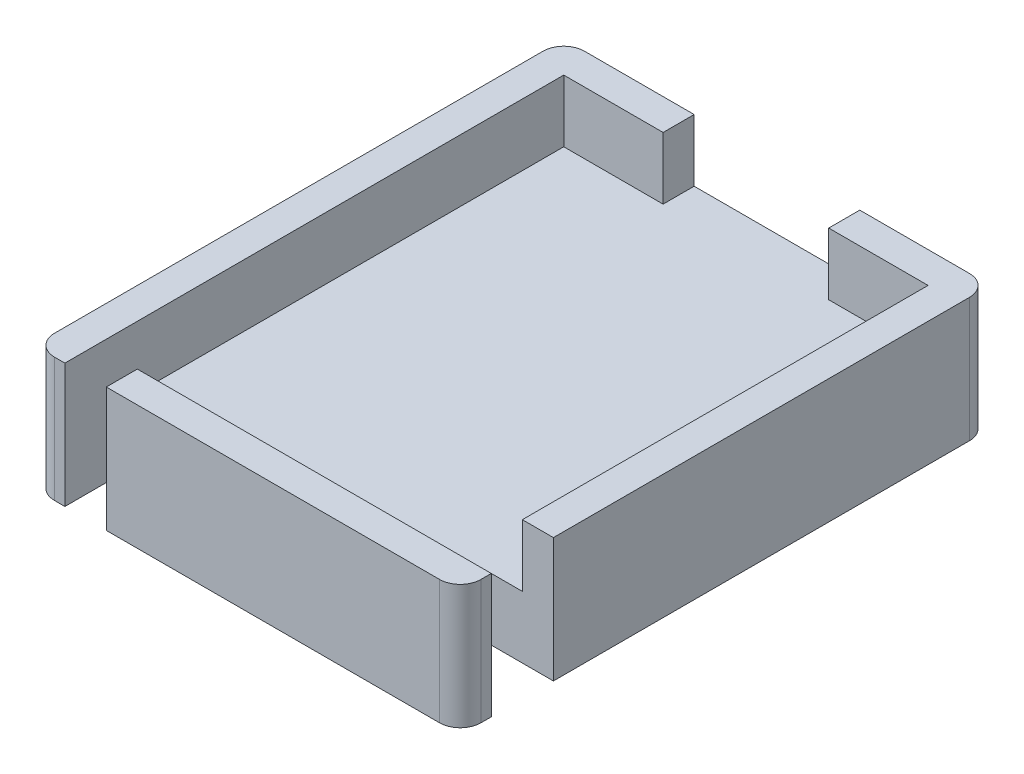
ISO-10303-21;
HEADER;
FILE_DESCRIPTION(('STEP AP214'),'2;1');
FILE_NAME('part.step','',(''),(''),'','','');
FILE_SCHEMA(('AUTOMOTIVE_DESIGN { 1 0 10303 214 1 1 1 1 }'));
ENDSEC;
DATA;
#1=APPLICATION_CONTEXT('core data for automotive mechanical design processes');
#2=APPLICATION_PROTOCOL_DEFINITION('international standard','automotive_design',2000,#1);
#3=PRODUCT_CONTEXT('',#1,'mechanical');
#4=PRODUCT('Part','Part','',(#3));
#5=PRODUCT_RELATED_PRODUCT_CATEGORY('part','',(#4));
#6=PRODUCT_DEFINITION_FORMATION('','',#4);
#7=PRODUCT_DEFINITION_CONTEXT('part definition',#1,'design');
#8=PRODUCT_DEFINITION('design','',#6,#7);
#9=PRODUCT_DEFINITION_SHAPE('','',#8);
#10=(LENGTH_UNIT() NAMED_UNIT(*) SI_UNIT(.MILLI.,.METRE.));
#11=(NAMED_UNIT(*) PLANE_ANGLE_UNIT() SI_UNIT($,.RADIAN.));
#12=(NAMED_UNIT(*) SI_UNIT($,.STERADIAN.) SOLID_ANGLE_UNIT());
#13=UNCERTAINTY_MEASURE_WITH_UNIT(LENGTH_MEASURE(1.E-05),#10,'distance_accuracy_value','');
#14=(GEOMETRIC_REPRESENTATION_CONTEXT(3) GLOBAL_UNCERTAINTY_ASSIGNED_CONTEXT((#13)) GLOBAL_UNIT_ASSIGNED_CONTEXT((#10,
#11,#12)) REPRESENTATION_CONTEXT('',''));
#15=CARTESIAN_POINT('',(0.,0.,0.));
#16=DIRECTION('',(0.,0.,1.));
#17=DIRECTION('',(1.,0.,0.));
#18=AXIS2_PLACEMENT_3D('',#15,#16,#17);
#19=CARTESIAN_POINT('',(0.,3.,12.8));
#20=DIRECTION('',(0.,0.,-1.));
#21=DIRECTION('',(-1.,0.,0.));
#22=AXIS2_PLACEMENT_3D('',#19,#20,#21);
#23=PLANE('',#22);
#24=DIRECTION('',(1.,0.,0.));
#25=VECTOR('',#24,1.);
#26=CARTESIAN_POINT('',(0.,3.,12.8));
#27=LINE('',#26,#25);
#28=CARTESIAN_POINT('',(-6.8,3.,12.8));
#29=VERTEX_POINT('',#28);
#30=CARTESIAN_POINT('',(9.3,3.,12.8));
#31=VERTEX_POINT('',#30);
#32=EDGE_CURVE('E292',#29,#31,#27,.T.);
#33=ORIENTED_EDGE('',*,*,#32,.F.);
#34=DIRECTION('',(0.,1.,0.));
#35=VECTOR('',#34,1.);
#36=CARTESIAN_POINT('',(-6.8,3.,12.8));
#37=LINE('',#36,#35);
#38=CARTESIAN_POINT('',(-6.8,-3.,12.8));
#39=VERTEX_POINT('',#38);
#40=EDGE_CURVE('E223',#39,#29,#37,.T.);
#41=ORIENTED_EDGE('',*,*,#40,.F.);
#42=DIRECTION('',(1.,0.,0.));
#43=VECTOR('',#42,1.);
#44=CARTESIAN_POINT('',(0.,-3.,12.8));
#45=LINE('',#44,#43);
#46=CARTESIAN_POINT('',(9.3,-3.,12.8));
#47=VERTEX_POINT('',#46);
#48=EDGE_CURVE('E265',#39,#47,#45,.T.);
#49=ORIENTED_EDGE('',*,*,#48,.T.);
#50=DIRECTION('',(0.,-1.,0.));
#51=VECTOR('',#50,1.);
#52=CARTESIAN_POINT('',(9.3,3.,12.8));
#53=LINE('',#52,#51);
#54=EDGE_CURVE('E436',#31,#47,#53,.T.);
#55=ORIENTED_EDGE('',*,*,#54,.F.);
#56=EDGE_LOOP('',(#33,#41,#49,#55));
#57=FACE_BOUND('',#56,.T.);
#58=ADVANCED_FACE('F35',(#57),#23,.F.);
#59=CARTESIAN_POINT('',(0.,3.,0.));
#60=DIRECTION('',(0.,1.,0.));
#61=DIRECTION('',(0.,0.,1.));
#62=AXIS2_PLACEMENT_3D('',#59,#60,#61);
#63=PLANE('',#62);
#64=DIRECTION('',(0.,0.,1.));
#65=VECTOR('',#64,1.);
#66=CARTESIAN_POINT('',(-6.8,3.,8.8));
#67=LINE('',#66,#65);
#68=CARTESIAN_POINT('',(-6.8,3.,11.3));
#69=VERTEX_POINT('',#68);
#70=EDGE_CURVE('E214',#69,#29,#67,.T.);
#71=ORIENTED_EDGE('',*,*,#70,.T.);
#72=ORIENTED_EDGE('',*,*,#32,.T.);
#73=CARTESIAN_POINT('',(9.3,3.,11.8));
#74=DIRECTION('',(0.,1.,0.));
#75=DIRECTION('',(0.,0.,1.));
#76=AXIS2_PLACEMENT_3D('',#73,#74,#75);
#77=CIRCLE('',#76,0.999999999999999);
#78=CARTESIAN_POINT('',(10.3,3.,11.8));
#79=VERTEX_POINT('',#78);
#80=EDGE_CURVE('E296',#79,#31,#77,.F.);
#81=ORIENTED_EDGE('',*,*,#80,.F.);
#82=DIRECTION('',(0.,0.,1.));
#83=VECTOR('',#82,1.);
#84=CARTESIAN_POINT('',(10.3,3.,0.));
#85=LINE('',#84,#83);
#86=CARTESIAN_POINT('',(10.3,3.,11.3));
#87=VERTEX_POINT('',#86);
#88=EDGE_CURVE('E299',#87,#79,#85,.T.);
#89=ORIENTED_EDGE('',*,*,#88,.F.);
#90=DIRECTION('',(1.,0.,0.));
#91=VECTOR('',#90,1.);
#92=CARTESIAN_POINT('',(0.,3.,11.3));
#93=LINE('',#92,#91);
#94=EDGE_CURVE('E314',#69,#87,#93,.T.);
#95=ORIENTED_EDGE('',*,*,#94,.F.);
#96=EDGE_LOOP('',(#71,#72,#81,#89,#95));
#97=FACE_BOUND('',#96,.T.);
#98=ADVANCED_FACE('F415',(#97),#63,.T.);
#99=CARTESIAN_POINT('',(10.3,3.,0.));
#100=DIRECTION('',(1.,0.,0.));
#101=DIRECTION('',(0.,0.,-1.));
#102=AXIS2_PLACEMENT_3D('',#99,#100,#101);
#103=PLANE('',#102);
#104=DIRECTION('',(0.,1.,0.));
#105=VECTOR('',#104,1.);
#106=CARTESIAN_POINT('',(10.3,3.,8.3));
#107=LINE('',#106,#105);
#108=CARTESIAN_POINT('',(10.3,-3.,8.3));
#109=VERTEX_POINT('',#108);
#110=CARTESIAN_POINT('',(10.3,3.,8.3));
#111=VERTEX_POINT('',#110);
#112=EDGE_CURVE('E229',#109,#111,#107,.T.);
#113=ORIENTED_EDGE('',*,*,#112,.F.);
#114=DIRECTION('',(0.,0.,1.));
#115=VECTOR('',#114,1.);
#116=CARTESIAN_POINT('',(10.3,-3.,0.));
#117=LINE('',#116,#115);
#118=CARTESIAN_POINT('',(10.3,-3.,-11.8));
#119=VERTEX_POINT('',#118);
#120=EDGE_CURVE('E272',#119,#109,#117,.T.);
#121=ORIENTED_EDGE('',*,*,#120,.F.);
#122=DIRECTION('',(0.,-1.,0.));
#123=VECTOR('',#122,1.);
#124=CARTESIAN_POINT('',(10.3,3.,-11.8));
#125=LINE('',#124,#123);
#126=CARTESIAN_POINT('',(10.3,3.,-11.8));
#127=VERTEX_POINT('',#126);
#128=EDGE_CURVE('E443',#127,#119,#125,.T.);
#129=ORIENTED_EDGE('',*,*,#128,.F.);
#130=EDGE_CURVE('E300',#127,#111,#85,.T.);
#131=ORIENTED_EDGE('',*,*,#130,.T.);
#132=EDGE_LOOP('',(#113,#121,#129,#131));
#133=FACE_BOUND('',#132,.T.);
#134=ADVANCED_FACE('F412',(#133),#103,.T.);
#135=DIRECTION('',(1.,0.,0.));
#136=VECTOR('',#135,1.);
#137=CARTESIAN_POINT('',(6.3,3.,8.3));
#138=LINE('',#137,#136);
#139=CARTESIAN_POINT('',(8.8,3.,8.3));
#140=VERTEX_POINT('',#139);
#141=EDGE_CURVE('E236',#140,#111,#138,.T.);
#142=ORIENTED_EDGE('',*,*,#141,.T.);
#143=ORIENTED_EDGE('',*,*,#130,.F.);
#144=CARTESIAN_POINT('',(9.3,3.,-11.8));
#145=DIRECTION('',(0.,1.,0.));
#146=DIRECTION('',(0.,0.,1.));
#147=AXIS2_PLACEMENT_3D('',#144,#145,#146);
#148=CIRCLE('',#147,1.);
#149=CARTESIAN_POINT('',(9.3,3.,-12.8));
#150=VERTEX_POINT('',#149);
#151=EDGE_CURVE('E303',#150,#127,#148,.F.);
#152=ORIENTED_EDGE('',*,*,#151,.F.);
#153=DIRECTION('',(1.,0.,0.));
#154=VECTOR('',#153,1.);
#155=CARTESIAN_POINT('',(0.,3.,-12.8));
#156=LINE('',#155,#154);
#157=CARTESIAN_POINT('',(4.,3.,-12.8));
#158=VERTEX_POINT('',#157);
#159=EDGE_CURVE('E285',#158,#150,#156,.T.);
#160=ORIENTED_EDGE('',*,*,#159,.F.);
#161=DIRECTION('',(0.,0.,1.));
#162=VECTOR('',#161,1.);
#163=CARTESIAN_POINT('',(4.,3.,0.));
#164=LINE('',#163,#162);
#165=CARTESIAN_POINT('',(4.,3.,-11.3));
#166=VERTEX_POINT('',#165);
#167=EDGE_CURVE('E306',#158,#166,#164,.T.);
#168=ORIENTED_EDGE('',*,*,#167,.T.);
#169=DIRECTION('',(1.,0.,0.));
#170=VECTOR('',#169,1.);
#171=CARTESIAN_POINT('',(0.,3.,-11.3));
#172=LINE('',#171,#170);
#173=CARTESIAN_POINT('',(8.8,3.,-11.3));
#174=VERTEX_POINT('',#173);
#175=EDGE_CURVE('E308',#166,#174,#172,.T.);
#176=ORIENTED_EDGE('',*,*,#175,.T.);
#177=DIRECTION('',(0.,0.,1.));
#178=VECTOR('',#177,1.);
#179=CARTESIAN_POINT('',(8.8,3.,0.));
#180=LINE('',#179,#178);
#181=EDGE_CURVE('E310',#174,#140,#180,.T.);
#182=ORIENTED_EDGE('',*,*,#181,.T.);
#183=EDGE_LOOP('',(#142,#143,#152,#160,#168,#176,#182));
#184=FACE_BOUND('',#183,.T.);
#185=ADVANCED_FACE('F406',(#184),#63,.T.);
#186=CARTESIAN_POINT('',(-9.3,3.,-11.8));
#187=DIRECTION('',(0.,-1.,0.));
#188=DIRECTION('',(0.,0.,-1.));
#189=AXIS2_PLACEMENT_3D('',#186,#187,#188);
#190=CYLINDRICAL_SURFACE('',#189,1.);
#191=DIRECTION('',(0.,-1.,0.));
#192=VECTOR('',#191,1.);
#193=CARTESIAN_POINT('',(-9.3,3.,-12.8));
#194=LINE('',#193,#192);
#195=CARTESIAN_POINT('',(-9.3,3.,-12.8));
#196=VERTEX_POINT('',#195);
#197=CARTESIAN_POINT('',(-9.3,-3.,-12.8));
#198=VERTEX_POINT('',#197);
#199=EDGE_CURVE('E346',#196,#198,#194,.T.);
#200=ORIENTED_EDGE('',*,*,#199,.T.);
#201=CARTESIAN_POINT('',(-9.3,-3.,-11.8));
#202=DIRECTION('',(0.,1.,0.));
#203=DIRECTION('',(0.,0.,1.));
#204=AXIS2_PLACEMENT_3D('',#201,#202,#203);
#205=CIRCLE('',#204,1.);
#206=CARTESIAN_POINT('',(-10.3,-3.,-11.8));
#207=VERTEX_POINT('',#206);
#208=EDGE_CURVE('E256',#198,#207,#205,.T.);
#209=ORIENTED_EDGE('',*,*,#208,.T.);
#210=DIRECTION('',(0.,-1.,0.));
#211=VECTOR('',#210,1.);
#212=CARTESIAN_POINT('',(-10.3,3.,-11.8));
#213=LINE('',#212,#211);
#214=CARTESIAN_POINT('',(-10.3,3.,-11.8));
#215=VERTEX_POINT('',#214);
#216=EDGE_CURVE('E379',#215,#207,#213,.T.);
#217=ORIENTED_EDGE('',*,*,#216,.F.);
#218=CARTESIAN_POINT('',(-9.3,3.,-11.8));
#219=DIRECTION('',(0.,1.,0.));
#220=DIRECTION('',(0.,0.,1.));
#221=AXIS2_PLACEMENT_3D('',#218,#219,#220);
#222=CIRCLE('',#221,1.);
#223=EDGE_CURVE('E283',#196,#215,#222,.T.);
#224=ORIENTED_EDGE('',*,*,#223,.F.);
#225=EDGE_LOOP('',(#200,#209,#217,#224));
#226=FACE_BOUND('',#225,.T.);
#227=ADVANCED_FACE('F37',(#226),#190,.T.);
#228=CARTESIAN_POINT('',(-10.3,3.,0.));
#229=DIRECTION('',(1.,0.,0.));
#230=DIRECTION('',(0.,0.,-1.));
#231=AXIS2_PLACEMENT_3D('',#228,#229,#230);
#232=PLANE('',#231);
#233=ORIENTED_EDGE('',*,*,#216,.T.);
#234=DIRECTION('',(0.,0.,1.));
#235=VECTOR('',#234,1.);
#236=CARTESIAN_POINT('',(-10.3,-3.,0.));
#237=LINE('',#236,#235);
#238=CARTESIAN_POINT('',(-10.3,-3.,11.8));
#239=VERTEX_POINT('',#238);
#240=EDGE_CURVE('E259',#207,#239,#237,.T.);
#241=ORIENTED_EDGE('',*,*,#240,.T.);
#242=DIRECTION('',(0.,-1.,0.));
#243=VECTOR('',#242,1.);
#244=CARTESIAN_POINT('',(-10.3,3.,11.8));
#245=LINE('',#244,#243);
#246=CARTESIAN_POINT('',(-10.3,3.,11.8));
#247=VERTEX_POINT('',#246);
#248=EDGE_CURVE('E377',#247,#239,#245,.T.);
#249=ORIENTED_EDGE('',*,*,#248,.F.);
#250=DIRECTION('',(0.,0.,1.));
#251=VECTOR('',#250,1.);
#252=CARTESIAN_POINT('',(-10.3,3.,0.));
#253=LINE('',#252,#251);
#254=EDGE_CURVE('E287',#215,#247,#253,.T.);
#255=ORIENTED_EDGE('',*,*,#254,.F.);
#256=EDGE_LOOP('',(#233,#241,#249,#255));
#257=FACE_BOUND('',#256,.T.);
#258=ADVANCED_FACE('F375',(#257),#232,.F.);
#259=CARTESIAN_POINT('',(-9.3,3.,11.8));
#260=DIRECTION('',(0.,-1.,0.));
#261=DIRECTION('',(0.,0.,-1.));
#262=AXIS2_PLACEMENT_3D('',#259,#260,#261);
#263=CYLINDRICAL_SURFACE('',#262,1.);
#264=ORIENTED_EDGE('',*,*,#248,.T.);
#265=CARTESIAN_POINT('',(-9.3,-3.,11.8));
#266=DIRECTION('',(0.,1.,0.));
#267=DIRECTION('',(0.,0.,1.));
#268=AXIS2_PLACEMENT_3D('',#265,#266,#267);
#269=CIRCLE('',#268,1.);
#270=CARTESIAN_POINT('',(-9.3,-3.,12.8));
#271=VERTEX_POINT('',#270);
#272=EDGE_CURVE('E262',#271,#239,#269,.F.);
#273=ORIENTED_EDGE('',*,*,#272,.F.);
#274=DIRECTION('',(0.,-1.,0.));
#275=VECTOR('',#274,1.);
#276=CARTESIAN_POINT('',(-9.3,3.,12.8));
#277=LINE('',#276,#275);
#278=CARTESIAN_POINT('',(-9.3,3.,12.8));
#279=VERTEX_POINT('',#278);
#280=EDGE_CURVE('E368',#279,#271,#277,.T.);
#281=ORIENTED_EDGE('',*,*,#280,.F.);
#282=CARTESIAN_POINT('',(-9.3,3.,11.8));
#283=DIRECTION('',(0.,1.,0.));
#284=DIRECTION('',(0.,0.,1.));
#285=AXIS2_PLACEMENT_3D('',#282,#283,#284);
#286=CIRCLE('',#285,1.);
#287=EDGE_CURVE('E289',#279,#247,#286,.F.);
#288=ORIENTED_EDGE('',*,*,#287,.T.);
#289=EDGE_LOOP('',(#264,#273,#281,#288));
#290=FACE_BOUND('',#289,.T.);
#291=ADVANCED_FACE('F411',(#290),#263,.T.);
#292=CARTESIAN_POINT('',(-8.8,-3.,12.8));
#293=VERTEX_POINT('',#292);
#294=EDGE_CURVE('E266',#271,#293,#45,.T.);
#295=ORIENTED_EDGE('',*,*,#294,.T.);
#296=DIRECTION('',(0.,-1.,0.));
#297=VECTOR('',#296,1.);
#298=CARTESIAN_POINT('',(-8.8,3.,12.8));
#299=LINE('',#298,#297);
#300=CARTESIAN_POINT('',(-8.8,3.,12.8));
#301=VERTEX_POINT('',#300);
#302=EDGE_CURVE('E209',#301,#293,#299,.T.);
#303=ORIENTED_EDGE('',*,*,#302,.F.);
#304=EDGE_CURVE('E293',#279,#301,#27,.T.);
#305=ORIENTED_EDGE('',*,*,#304,.F.);
#306=ORIENTED_EDGE('',*,*,#280,.T.);
#307=EDGE_LOOP('',(#295,#303,#305,#306));
#308=FACE_BOUND('',#307,.T.);
#309=ADVANCED_FACE('F367',(#308),#23,.F.);
#310=CARTESIAN_POINT('',(9.3,3.,11.8));
#311=DIRECTION('',(0.,-1.,0.));
#312=DIRECTION('',(0.,0.,-1.));
#313=AXIS2_PLACEMENT_3D('',#310,#311,#312);
#314=CYLINDRICAL_SURFACE('',#313,0.999999999999999);
#315=ORIENTED_EDGE('',*,*,#54,.T.);
#316=CARTESIAN_POINT('',(9.3,-3.,11.8));
#317=DIRECTION('',(0.,1.,0.));
#318=DIRECTION('',(0.,0.,1.));
#319=AXIS2_PLACEMENT_3D('',#316,#317,#318);
#320=CIRCLE('',#319,0.999999999999999);
#321=CARTESIAN_POINT('',(10.3,-3.,11.8));
#322=VERTEX_POINT('',#321);
#323=EDGE_CURVE('E268',#322,#47,#320,.F.);
#324=ORIENTED_EDGE('',*,*,#323,.F.);
#325=DIRECTION('',(0.,-1.,0.));
#326=VECTOR('',#325,1.);
#327=CARTESIAN_POINT('',(10.3,3.,11.8));
#328=LINE('',#327,#326);
#329=EDGE_CURVE('E438',#79,#322,#328,.T.);
#330=ORIENTED_EDGE('',*,*,#329,.F.);
#331=ORIENTED_EDGE('',*,*,#80,.T.);
#332=EDGE_LOOP('',(#315,#324,#330,#331));
#333=FACE_BOUND('',#332,.T.);
#334=ADVANCED_FACE('F427',(#333),#314,.T.);
#335=DIRECTION('',(0.,-1.,0.));
#336=VECTOR('',#335,1.);
#337=CARTESIAN_POINT('',(10.3,3.,11.3));
#338=LINE('',#337,#336);
#339=CARTESIAN_POINT('',(10.3,-3.,11.3));
#340=VERTEX_POINT('',#339);
#341=EDGE_CURVE('E232',#87,#340,#338,.T.);
#342=ORIENTED_EDGE('',*,*,#341,.F.);
#343=ORIENTED_EDGE('',*,*,#88,.T.);
#344=ORIENTED_EDGE('',*,*,#329,.T.);
#345=EDGE_CURVE('E271',#340,#322,#117,.T.);
#346=ORIENTED_EDGE('',*,*,#345,.F.);
#347=EDGE_LOOP('',(#342,#343,#344,#346));
#348=FACE_BOUND('',#347,.T.);
#349=ADVANCED_FACE('F432',(#348),#103,.T.);
#350=CARTESIAN_POINT('',(9.3,3.,-11.8));
#351=DIRECTION('',(0.,-1.,0.));
#352=DIRECTION('',(0.,0.,-1.));
#353=AXIS2_PLACEMENT_3D('',#350,#351,#352);
#354=CYLINDRICAL_SURFACE('',#353,1.);
#355=ORIENTED_EDGE('',*,*,#128,.T.);
#356=CARTESIAN_POINT('',(9.3,-3.,-11.8));
#357=DIRECTION('',(0.,1.,0.));
#358=DIRECTION('',(0.,0.,1.));
#359=AXIS2_PLACEMENT_3D('',#356,#357,#358);
#360=CIRCLE('',#359,1.);
#361=CARTESIAN_POINT('',(9.3,-3.,-12.8));
#362=VERTEX_POINT('',#361);
#363=EDGE_CURVE('E250',#362,#119,#360,.F.);
#364=ORIENTED_EDGE('',*,*,#363,.F.);
#365=DIRECTION('',(0.,-1.,0.));
#366=VECTOR('',#365,1.);
#367=CARTESIAN_POINT('',(9.3,3.,-12.8));
#368=LINE('',#367,#366);
#369=EDGE_CURVE('E394',#150,#362,#368,.T.);
#370=ORIENTED_EDGE('',*,*,#369,.F.);
#371=ORIENTED_EDGE('',*,*,#151,.T.);
#372=EDGE_LOOP('',(#355,#364,#370,#371));
#373=FACE_BOUND('',#372,.T.);
#374=ADVANCED_FACE('F466',(#373),#354,.T.);
#375=CARTESIAN_POINT('',(0.,3.,-12.8));
#376=DIRECTION('',(0.,0.,-1.));
#377=DIRECTION('',(-1.,0.,0.));
#378=AXIS2_PLACEMENT_3D('',#375,#376,#377);
#379=PLANE('',#378);
#380=ORIENTED_EDGE('',*,*,#369,.T.);
#381=DIRECTION('',(1.,0.,0.));
#382=VECTOR('',#381,1.);
#383=CARTESIAN_POINT('',(0.,-3.,-12.8));
#384=LINE('',#383,#382);
#385=EDGE_CURVE('E253',#198,#362,#384,.T.);
#386=ORIENTED_EDGE('',*,*,#385,.F.);
#387=ORIENTED_EDGE('',*,*,#199,.F.);
#388=CARTESIAN_POINT('',(-4.,3.,-12.8));
#389=VERTEX_POINT('',#388);
#390=EDGE_CURVE('E280',#196,#389,#156,.T.);
#391=ORIENTED_EDGE('',*,*,#390,.T.);
#392=DIRECTION('',(0.,-1.,0.));
#393=VECTOR('',#392,1.);
#394=CARTESIAN_POINT('',(-4.,3.,-12.8));
#395=LINE('',#394,#393);
#396=CARTESIAN_POINT('',(-4.,0.,-12.8));
#397=VERTEX_POINT('',#396);
#398=EDGE_CURVE('E321',#389,#397,#395,.T.);
#399=ORIENTED_EDGE('',*,*,#398,.T.);
#400=DIRECTION('',(1.,0.,0.));
#401=VECTOR('',#400,1.);
#402=CARTESIAN_POINT('',(0.,0.,-12.8));
#403=LINE('',#402,#401);
#404=CARTESIAN_POINT('',(4.,0.,-12.8));
#405=VERTEX_POINT('',#404);
#406=EDGE_CURVE('E249',#397,#405,#403,.T.);
#407=ORIENTED_EDGE('',*,*,#406,.T.);
#408=DIRECTION('',(0.,-1.,0.));
#409=VECTOR('',#408,1.);
#410=CARTESIAN_POINT('',(4.,3.,-12.8));
#411=LINE('',#410,#409);
#412=EDGE_CURVE('E391',#158,#405,#411,.T.);
#413=ORIENTED_EDGE('',*,*,#412,.F.);
#414=ORIENTED_EDGE('',*,*,#159,.T.);
#415=EDGE_LOOP('',(#380,#386,#387,#391,#399,#407,#413,#414));
#416=FACE_BOUND('',#415,.T.);
#417=ADVANCED_FACE('F403',(#416),#379,.T.);
#418=CARTESIAN_POINT('',(4.,3.,0.));
#419=DIRECTION('',(1.,0.,0.));
#420=DIRECTION('',(0.,0.,-1.));
#421=AXIS2_PLACEMENT_3D('',#418,#419,#420);
#422=PLANE('',#421);
#423=DIRECTION('',(0.,0.,1.));
#424=VECTOR('',#423,1.);
#425=CARTESIAN_POINT('',(4.,0.,0.));
#426=LINE('',#425,#424);
#427=CARTESIAN_POINT('',(4.,0.,-11.3));
#428=VERTEX_POINT('',#427);
#429=EDGE_CURVE('E275',#405,#428,#426,.T.);
#430=ORIENTED_EDGE('',*,*,#429,.T.);
#431=DIRECTION('',(0.,-1.,0.));
#432=VECTOR('',#431,1.);
#433=CARTESIAN_POINT('',(4.,3.,-11.3));
#434=LINE('',#433,#432);
#435=EDGE_CURVE('E395',#166,#428,#434,.T.);
#436=ORIENTED_EDGE('',*,*,#435,.F.);
#437=ORIENTED_EDGE('',*,*,#167,.F.);
#438=ORIENTED_EDGE('',*,*,#412,.T.);
#439=EDGE_LOOP('',(#430,#436,#437,#438));
#440=FACE_BOUND('',#439,.T.);
#441=ADVANCED_FACE('F459',(#440),#422,.F.);
#442=CARTESIAN_POINT('',(0.,3.,-11.3));
#443=DIRECTION('',(0.,0.,-1.));
#444=DIRECTION('',(-1.,0.,0.));
#445=AXIS2_PLACEMENT_3D('',#442,#443,#444);
#446=PLANE('',#445);
#447=DIRECTION('',(1.,0.,0.));
#448=VECTOR('',#447,1.);
#449=CARTESIAN_POINT('',(0.,0.,-11.3));
#450=LINE('',#449,#448);
#451=CARTESIAN_POINT('',(8.8,0.,-11.3));
#452=VERTEX_POINT('',#451);
#453=EDGE_CURVE('E322',#428,#452,#450,.T.);
#454=ORIENTED_EDGE('',*,*,#453,.T.);
#455=DIRECTION('',(0.,-1.,0.));
#456=VECTOR('',#455,1.);
#457=CARTESIAN_POINT('',(8.8,3.,-11.3));
#458=LINE('',#457,#456);
#459=EDGE_CURVE('E357',#174,#452,#458,.T.);
#460=ORIENTED_EDGE('',*,*,#459,.F.);
#461=ORIENTED_EDGE('',*,*,#175,.F.);
#462=ORIENTED_EDGE('',*,*,#435,.T.);
#463=EDGE_LOOP('',(#454,#460,#461,#462));
#464=FACE_BOUND('',#463,.T.);
#465=ADVANCED_FACE('F455',(#464),#446,.F.);
#466=CARTESIAN_POINT('',(8.8,3.,0.));
#467=DIRECTION('',(1.,0.,0.));
#468=DIRECTION('',(0.,0.,-1.));
#469=AXIS2_PLACEMENT_3D('',#466,#467,#468);
#470=PLANE('',#469);
#471=DIRECTION('',(0.,0.,1.));
#472=VECTOR('',#471,1.);
#473=CARTESIAN_POINT('',(8.8,0.,0.));
#474=LINE('',#473,#472);
#475=CARTESIAN_POINT('',(8.8,0.,8.3));
#476=VERTEX_POINT('',#475);
#477=EDGE_CURVE('E325',#452,#476,#474,.T.);
#478=ORIENTED_EDGE('',*,*,#477,.T.);
#479=DIRECTION('',(0.,1.,0.));
#480=VECTOR('',#479,1.);
#481=CARTESIAN_POINT('',(8.8,3.,8.3));
#482=LINE('',#481,#480);
#483=EDGE_CURVE('E241',#476,#140,#482,.T.);
#484=ORIENTED_EDGE('',*,*,#483,.T.);
#485=ORIENTED_EDGE('',*,*,#181,.F.);
#486=ORIENTED_EDGE('',*,*,#459,.T.);
#487=EDGE_LOOP('',(#478,#484,#485,#486));
#488=FACE_BOUND('',#487,.T.);
#489=ADVANCED_FACE('F452',(#488),#470,.F.);
#490=CARTESIAN_POINT('',(0.,3.,11.3));
#491=DIRECTION('',(0.,0.,-1.));
#492=DIRECTION('',(-1.,0.,0.));
#493=AXIS2_PLACEMENT_3D('',#490,#491,#492);
#494=PLANE('',#493);
#495=DIRECTION('',(0.,-1.,0.));
#496=VECTOR('',#495,1.);
#497=CARTESIAN_POINT('',(-6.8,3.,11.3));
#498=LINE('',#497,#496);
#499=CARTESIAN_POINT('',(-6.8,0.,11.3));
#500=VERTEX_POINT('',#499);
#501=EDGE_CURVE('E226',#69,#500,#498,.T.);
#502=ORIENTED_EDGE('',*,*,#501,.F.);
#503=ORIENTED_EDGE('',*,*,#94,.T.);
#504=ORIENTED_EDGE('',*,*,#341,.T.);
#505=DIRECTION('',(1.,0.,0.));
#506=VECTOR('',#505,1.);
#507=CARTESIAN_POINT('',(6.3,-3.,11.3));
#508=LINE('',#507,#506);
#509=CARTESIAN_POINT('',(6.3,-3.,11.3));
#510=VERTEX_POINT('',#509);
#511=EDGE_CURVE('E242',#510,#340,#508,.T.);
#512=ORIENTED_EDGE('',*,*,#511,.F.);
#513=DIRECTION('',(0.,-1.,0.));
#514=VECTOR('',#513,1.);
#515=CARTESIAN_POINT('',(6.3,3.,11.3));
#516=LINE('',#515,#514);
#517=CARTESIAN_POINT('',(6.3,0.,11.3));
#518=VERTEX_POINT('',#517);
#519=EDGE_CURVE('E231',#518,#510,#516,.T.);
#520=ORIENTED_EDGE('',*,*,#519,.F.);
#521=DIRECTION('',(1.,0.,0.));
#522=VECTOR('',#521,1.);
#523=CARTESIAN_POINT('',(0.,0.,11.3));
#524=LINE('',#523,#522);
#525=EDGE_CURVE('E329',#500,#518,#524,.T.);
#526=ORIENTED_EDGE('',*,*,#525,.F.);
#527=EDGE_LOOP('',(#502,#503,#504,#512,#520,#526));
#528=FACE_BOUND('',#527,.T.);
#529=ADVANCED_FACE('F492',(#528),#494,.T.);
#530=CARTESIAN_POINT('',(-8.8,3.,0.));
#531=DIRECTION('',(1.,0.,0.));
#532=DIRECTION('',(0.,0.,-1.));
#533=AXIS2_PLACEMENT_3D('',#530,#531,#532);
#534=PLANE('',#533);
#535=DIRECTION('',(0.,-1.,0.));
#536=VECTOR('',#535,1.);
#537=CARTESIAN_POINT('',(-8.8,3.,8.8));
#538=LINE('',#537,#536);
#539=CARTESIAN_POINT('',(-8.8,0.,8.8));
#540=VERTEX_POINT('',#539);
#541=CARTESIAN_POINT('',(-8.8,-3.,8.8));
#542=VERTEX_POINT('',#541);
#543=EDGE_CURVE('E194',#540,#542,#538,.T.);
#544=ORIENTED_EDGE('',*,*,#543,.F.);
#545=DIRECTION('',(0.,0.,1.));
#546=VECTOR('',#545,1.);
#547=CARTESIAN_POINT('',(-8.8,0.,0.));
#548=LINE('',#547,#546);
#549=CARTESIAN_POINT('',(-8.8,0.,-11.3));
#550=VERTEX_POINT('',#549);
#551=EDGE_CURVE('E331',#550,#540,#548,.T.);
#552=ORIENTED_EDGE('',*,*,#551,.F.);
#553=DIRECTION('',(0.,-1.,0.));
#554=VECTOR('',#553,1.);
#555=CARTESIAN_POINT('',(-8.8,3.,-11.3));
#556=LINE('',#555,#554);
#557=CARTESIAN_POINT('',(-8.8,3.,-11.3));
#558=VERTEX_POINT('',#557);
#559=EDGE_CURVE('E353',#558,#550,#556,.T.);
#560=ORIENTED_EDGE('',*,*,#559,.F.);
#561=DIRECTION('',(0.,0.,1.));
#562=VECTOR('',#561,1.);
#563=CARTESIAN_POINT('',(-8.8,3.,0.));
#564=LINE('',#563,#562);
#565=EDGE_CURVE('E316',#558,#301,#564,.T.);
#566=ORIENTED_EDGE('',*,*,#565,.T.);
#567=ORIENTED_EDGE('',*,*,#302,.T.);
#568=DIRECTION('',(0.,0.,1.));
#569=VECTOR('',#568,1.);
#570=CARTESIAN_POINT('',(-8.8,-3.,8.8));
#571=LINE('',#570,#569);
#572=EDGE_CURVE('E206',#542,#293,#571,.T.);
#573=ORIENTED_EDGE('',*,*,#572,.F.);
#574=EDGE_LOOP('',(#544,#552,#560,#566,#567,#573));
#575=FACE_BOUND('',#574,.T.);
#576=ADVANCED_FACE('F207',(#575),#534,.T.);
#577=CARTESIAN_POINT('',(-4.,0.,-11.3));
#578=VERTEX_POINT('',#577);
#579=EDGE_CURVE('E326',#550,#578,#450,.T.);
#580=ORIENTED_EDGE('',*,*,#579,.T.);
#581=DIRECTION('',(0.,-1.,0.));
#582=VECTOR('',#581,1.);
#583=CARTESIAN_POINT('',(-4.,3.,-11.3));
#584=LINE('',#583,#582);
#585=CARTESIAN_POINT('',(-4.,3.,-11.3));
#586=VERTEX_POINT('',#585);
#587=EDGE_CURVE('E335',#586,#578,#584,.T.);
#588=ORIENTED_EDGE('',*,*,#587,.F.);
#589=EDGE_CURVE('E311',#558,#586,#172,.T.);
#590=ORIENTED_EDGE('',*,*,#589,.F.);
#591=ORIENTED_EDGE('',*,*,#559,.T.);
#592=EDGE_LOOP('',(#580,#588,#590,#591));
#593=FACE_BOUND('',#592,.T.);
#594=ADVANCED_FACE('F359',(#593),#446,.F.);
#595=CARTESIAN_POINT('',(-4.,3.,0.));
#596=DIRECTION('',(1.,0.,0.));
#597=DIRECTION('',(0.,0.,-1.));
#598=AXIS2_PLACEMENT_3D('',#595,#596,#597);
#599=PLANE('',#598);
#600=DIRECTION('',(0.,0.,1.));
#601=VECTOR('',#600,1.);
#602=CARTESIAN_POINT('',(-4.,0.,0.));
#603=LINE('',#602,#601);
#604=EDGE_CURVE('E284',#397,#578,#603,.T.);
#605=ORIENTED_EDGE('',*,*,#604,.F.);
#606=ORIENTED_EDGE('',*,*,#398,.F.);
#607=DIRECTION('',(0.,0.,1.));
#608=VECTOR('',#607,1.);
#609=CARTESIAN_POINT('',(-4.,3.,0.));
#610=LINE('',#609,#608);
#611=EDGE_CURVE('E318',#389,#586,#610,.T.);
#612=ORIENTED_EDGE('',*,*,#611,.T.);
#613=ORIENTED_EDGE('',*,*,#587,.T.);
#614=EDGE_LOOP('',(#605,#606,#612,#613));
#615=FACE_BOUND('',#614,.T.);
#616=ADVANCED_FACE('F401',(#615),#599,.T.);
#617=ORIENTED_EDGE('',*,*,#304,.T.);
#618=ORIENTED_EDGE('',*,*,#565,.F.);
#619=ORIENTED_EDGE('',*,*,#589,.T.);
#620=ORIENTED_EDGE('',*,*,#611,.F.);
#621=ORIENTED_EDGE('',*,*,#390,.F.);
#622=ORIENTED_EDGE('',*,*,#223,.T.);
#623=ORIENTED_EDGE('',*,*,#254,.T.);
#624=ORIENTED_EDGE('',*,*,#287,.F.);
#625=EDGE_LOOP('',(#617,#618,#619,#620,#621,#622,#623,#624));
#626=FACE_BOUND('',#625,.T.);
#627=ADVANCED_FACE('F363',(#626),#63,.T.);
#628=CARTESIAN_POINT('',(0.,-3.,0.));
#629=DIRECTION('',(0.,1.,0.));
#630=DIRECTION('',(0.,0.,1.));
#631=AXIS2_PLACEMENT_3D('',#628,#629,#630);
#632=PLANE('',#631);
#633=ORIENTED_EDGE('',*,*,#48,.F.);
#634=DIRECTION('',(0.,0.,1.));
#635=VECTOR('',#634,1.);
#636=CARTESIAN_POINT('',(-6.8,-3.,8.8));
#637=LINE('',#636,#635);
#638=CARTESIAN_POINT('',(-6.8,-3.,8.8));
#639=VERTEX_POINT('',#638);
#640=EDGE_CURVE('E213',#639,#39,#637,.T.);
#641=ORIENTED_EDGE('',*,*,#640,.F.);
#642=DIRECTION('',(1.,0.,0.));
#643=VECTOR('',#642,1.);
#644=CARTESIAN_POINT('',(-8.8,-3.,8.8));
#645=LINE('',#644,#643);
#646=EDGE_CURVE('E198',#542,#639,#645,.T.);
#647=ORIENTED_EDGE('',*,*,#646,.F.);
#648=ORIENTED_EDGE('',*,*,#572,.T.);
#649=ORIENTED_EDGE('',*,*,#294,.F.);
#650=ORIENTED_EDGE('',*,*,#272,.T.);
#651=ORIENTED_EDGE('',*,*,#240,.F.);
#652=ORIENTED_EDGE('',*,*,#208,.F.);
#653=ORIENTED_EDGE('',*,*,#385,.T.);
#654=ORIENTED_EDGE('',*,*,#363,.T.);
#655=ORIENTED_EDGE('',*,*,#120,.T.);
#656=DIRECTION('',(1.,0.,0.));
#657=VECTOR('',#656,1.);
#658=CARTESIAN_POINT('',(6.3,-3.,8.3));
#659=LINE('',#658,#657);
#660=CARTESIAN_POINT('',(6.3,-3.,8.3));
#661=VERTEX_POINT('',#660);
#662=EDGE_CURVE('E239',#661,#109,#659,.T.);
#663=ORIENTED_EDGE('',*,*,#662,.F.);
#664=DIRECTION('',(0.,0.,-1.));
#665=VECTOR('',#664,1.);
#666=CARTESIAN_POINT('',(6.3,-3.,11.3));
#667=LINE('',#666,#665);
#668=EDGE_CURVE('E234',#510,#661,#667,.T.);
#669=ORIENTED_EDGE('',*,*,#668,.F.);
#670=ORIENTED_EDGE('',*,*,#511,.T.);
#671=ORIENTED_EDGE('',*,*,#345,.T.);
#672=ORIENTED_EDGE('',*,*,#323,.T.);
#673=EDGE_LOOP('',(#633,#641,#647,#648,#649,#650,#651,#652,#653,#654,#655,#663,#669,#670,#671,#672));
#674=FACE_BOUND('',#673,.T.);
#675=ADVANCED_FACE('F217',(#674),#632,.F.);
#676=CARTESIAN_POINT('',(0.,0.,0.));
#677=DIRECTION('',(0.,1.,0.));
#678=DIRECTION('',(0.,0.,1.));
#679=AXIS2_PLACEMENT_3D('',#676,#677,#678);
#680=PLANE('',#679);
#681=DIRECTION('',(0.,0.,-1.));
#682=VECTOR('',#681,1.);
#683=CARTESIAN_POINT('',(-6.8,0.,0.));
#684=LINE('',#683,#682);
#685=CARTESIAN_POINT('',(-6.8,0.,8.8));
#686=VERTEX_POINT('',#685);
#687=EDGE_CURVE('E11',#500,#686,#684,.T.);
#688=ORIENTED_EDGE('',*,*,#687,.F.);
#689=ORIENTED_EDGE('',*,*,#525,.T.);
#690=DIRECTION('',(0.,0.,-1.));
#691=VECTOR('',#690,1.);
#692=CARTESIAN_POINT('',(6.3,0.,0.));
#693=LINE('',#692,#691);
#694=CARTESIAN_POINT('',(6.3,0.,8.3));
#695=VERTEX_POINT('',#694);
#696=EDGE_CURVE('E342',#518,#695,#693,.T.);
#697=ORIENTED_EDGE('',*,*,#696,.T.);
#698=DIRECTION('',(-1.,0.,0.));
#699=VECTOR('',#698,1.);
#700=CARTESIAN_POINT('',(0.,0.,8.30000000000001));
#701=LINE('',#700,#699);
#702=EDGE_CURVE('E345',#476,#695,#701,.T.);
#703=ORIENTED_EDGE('',*,*,#702,.F.);
#704=ORIENTED_EDGE('',*,*,#477,.F.);
#705=ORIENTED_EDGE('',*,*,#453,.F.);
#706=ORIENTED_EDGE('',*,*,#429,.F.);
#707=ORIENTED_EDGE('',*,*,#406,.F.);
#708=ORIENTED_EDGE('',*,*,#604,.T.);
#709=ORIENTED_EDGE('',*,*,#579,.F.);
#710=ORIENTED_EDGE('',*,*,#551,.T.);
#711=DIRECTION('',(1.,0.,0.));
#712=VECTOR('',#711,1.);
#713=CARTESIAN_POINT('',(0.,0.,8.8));
#714=LINE('',#713,#712);
#715=EDGE_CURVE('E43',#540,#686,#714,.T.);
#716=ORIENTED_EDGE('',*,*,#715,.T.);
#717=EDGE_LOOP('',(#688,#689,#697,#703,#704,#705,#706,#707,#708,#709,#710,#716));
#718=FACE_BOUND('',#717,.T.);
#719=ADVANCED_FACE('F349',(#718),#680,.T.);
#720=CARTESIAN_POINT('',(6.3,3.,8.3));
#721=DIRECTION('',(0.,0.,-1.));
#722=DIRECTION('',(-1.,0.,0.));
#723=AXIS2_PLACEMENT_3D('',#720,#721,#722);
#724=PLANE('',#723);
#725=ORIENTED_EDGE('',*,*,#702,.T.);
#726=DIRECTION('',(0.,1.,0.));
#727=VECTOR('',#726,1.);
#728=CARTESIAN_POINT('',(6.3,3.,8.3));
#729=LINE('',#728,#727);
#730=EDGE_CURVE('E57',#661,#695,#729,.T.);
#731=ORIENTED_EDGE('',*,*,#730,.F.);
#732=ORIENTED_EDGE('',*,*,#662,.T.);
#733=ORIENTED_EDGE('',*,*,#112,.T.);
#734=ORIENTED_EDGE('',*,*,#141,.F.);
#735=ORIENTED_EDGE('',*,*,#483,.F.);
#736=EDGE_LOOP('',(#725,#731,#732,#733,#734,#735));
#737=FACE_BOUND('',#736,.T.);
#738=ADVANCED_FACE('F474',(#737),#724,.F.);
#739=CARTESIAN_POINT('',(6.3,0.,0.));
#740=DIRECTION('',(1.,0.,0.));
#741=DIRECTION('',(0.,0.,-1.));
#742=AXIS2_PLACEMENT_3D('',#739,#740,#741);
#743=PLANE('',#742);
#744=ORIENTED_EDGE('',*,*,#519,.T.);
#745=ORIENTED_EDGE('',*,*,#668,.T.);
#746=ORIENTED_EDGE('',*,*,#730,.T.);
#747=ORIENTED_EDGE('',*,*,#696,.F.);
#748=EDGE_LOOP('',(#744,#745,#746,#747));
#749=FACE_BOUND('',#748,.T.);
#750=ADVANCED_FACE('F475',(#749),#743,.T.);
#751=CARTESIAN_POINT('',(-6.8,3.,8.8));
#752=DIRECTION('',(1.,0.,0.));
#753=DIRECTION('',(0.,1.,0.));
#754=AXIS2_PLACEMENT_3D('',#751,#752,#753);
#755=PLANE('',#754);
#756=ORIENTED_EDGE('',*,*,#501,.T.);
#757=ORIENTED_EDGE('',*,*,#687,.T.);
#758=DIRECTION('',(0.,1.,0.));
#759=VECTOR('',#758,1.);
#760=CARTESIAN_POINT('',(-6.8,3.,8.8));
#761=LINE('',#760,#759);
#762=EDGE_CURVE('E50',#639,#686,#761,.T.);
#763=ORIENTED_EDGE('',*,*,#762,.F.);
#764=ORIENTED_EDGE('',*,*,#640,.T.);
#765=ORIENTED_EDGE('',*,*,#40,.T.);
#766=ORIENTED_EDGE('',*,*,#70,.F.);
#767=EDGE_LOOP('',(#756,#757,#763,#764,#765,#766));
#768=FACE_BOUND('',#767,.T.);
#769=ADVANCED_FACE('F489',(#768),#755,.F.);
#770=CARTESIAN_POINT('',(0.,0.,8.8));
#771=DIRECTION('',(0.,0.,1.));
#772=DIRECTION('',(1.,0.,0.));
#773=AXIS2_PLACEMENT_3D('',#770,#771,#772);
#774=PLANE('',#773);
#775=ORIENTED_EDGE('',*,*,#543,.T.);
#776=ORIENTED_EDGE('',*,*,#646,.T.);
#777=ORIENTED_EDGE('',*,*,#762,.T.);
#778=ORIENTED_EDGE('',*,*,#715,.F.);
#779=EDGE_LOOP('',(#775,#776,#777,#778));
#780=FACE_BOUND('',#779,.T.);
#781=ADVANCED_FACE('F196',(#780),#774,.T.);
#782=CLOSED_SHELL('',(#58,#98,#134,#185,#227,#258,#291,#309,#334,#349,#374,#417,#441,#465,#489,
#529,#576,#594,#616,#627,#675,#719,#738,#750,#769,#781));
#783=MANIFOLD_SOLID_BREP('B2',#782);
#784=ADVANCED_BREP_SHAPE_REPRESENTATION('',(#18,#783),#14);
#785=SHAPE_DEFINITION_REPRESENTATION(#9,#784);
ENDSEC;
END-ISO-10303-21;
